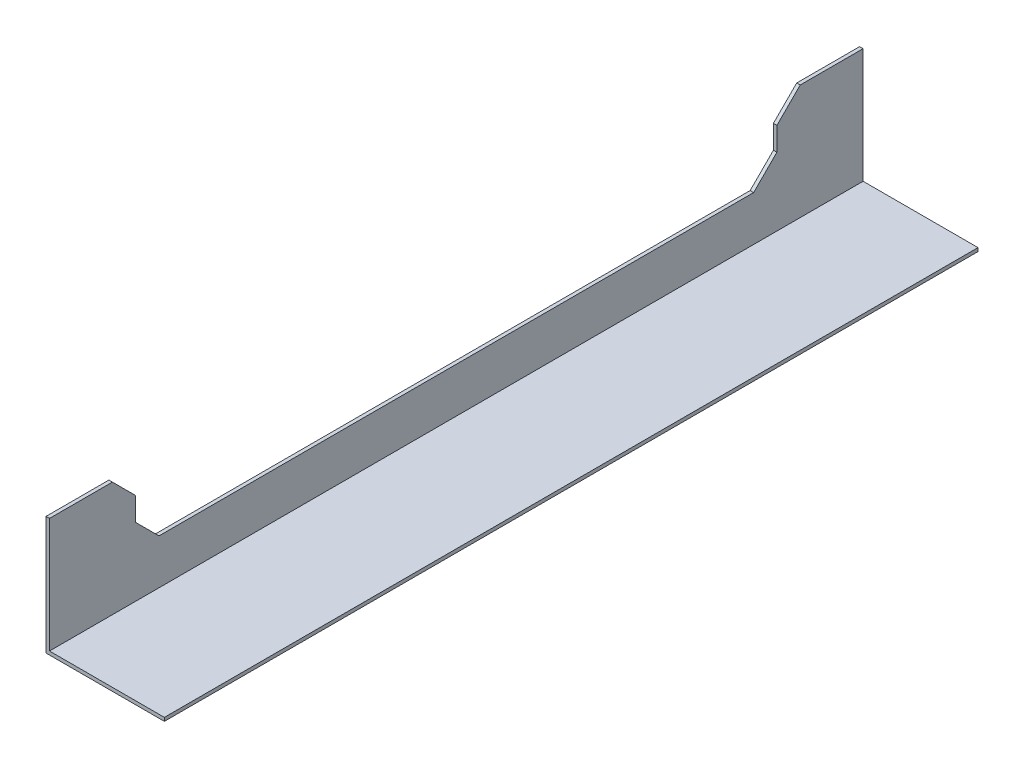
ISO-10303-21;
HEADER;
FILE_DESCRIPTION(('STEP AP214'),'2;1');
FILE_NAME('part.step','',(''),(''),'','','');
FILE_SCHEMA(('AUTOMOTIVE_DESIGN { 1 0 10303 214 1 1 1 1 }'));
ENDSEC;
DATA;
#1=APPLICATION_CONTEXT('core data for automotive mechanical design processes');
#2=APPLICATION_PROTOCOL_DEFINITION('international standard','automotive_design',2000,#1);
#3=PRODUCT_CONTEXT('',#1,'mechanical');
#4=PRODUCT('Part','Part','',(#3));
#5=PRODUCT_RELATED_PRODUCT_CATEGORY('part','',(#4));
#6=PRODUCT_DEFINITION_FORMATION('','',#4);
#7=PRODUCT_DEFINITION_CONTEXT('part definition',#1,'design');
#8=PRODUCT_DEFINITION('design','',#6,#7);
#9=PRODUCT_DEFINITION_SHAPE('','',#8);
#10=(LENGTH_UNIT() NAMED_UNIT(*) SI_UNIT(.MILLI.,.METRE.));
#11=(NAMED_UNIT(*) PLANE_ANGLE_UNIT() SI_UNIT($,.RADIAN.));
#12=(NAMED_UNIT(*) SI_UNIT($,.STERADIAN.) SOLID_ANGLE_UNIT());
#13=UNCERTAINTY_MEASURE_WITH_UNIT(LENGTH_MEASURE(1.E-05),#10,'distance_accuracy_value','');
#14=(GEOMETRIC_REPRESENTATION_CONTEXT(3) GLOBAL_UNCERTAINTY_ASSIGNED_CONTEXT((#13)) GLOBAL_UNIT_ASSIGNED_CONTEXT((#10,
#11,#12)) REPRESENTATION_CONTEXT('',''));
#15=CARTESIAN_POINT('',(0.,0.,0.));
#16=DIRECTION('',(0.,0.,1.));
#17=DIRECTION('',(1.,0.,0.));
#18=AXIS2_PLACEMENT_3D('',#15,#16,#17);
#19=CARTESIAN_POINT('',(1.49999999999995,1.49999999999995,349.2));
#20=DIRECTION('',(-1.,0.,0.));
#21=DIRECTION('',(0.,0.,1.));
#22=AXIS2_PLACEMENT_3D('',#19,#20,#21);
#23=PLANE('',#22);
#24=DIRECTION('',(0.,0.,-1.));
#25=VECTOR('',#24,1.);
#26=CARTESIAN_POINT('',(1.49999999999995,50.8,349.2));
#27=LINE('',#26,#25);
#28=CARTESIAN_POINT('',(1.49999999999995,50.8,27.));
#29=VERTEX_POINT('',#28);
#30=CARTESIAN_POINT('',(1.49999999999995,50.8,2.22044604925031E-13));
#31=VERTEX_POINT('',#30);
#32=EDGE_CURVE('E253',#29,#31,#27,.T.);
#33=ORIENTED_EDGE('',*,*,#32,.F.);
#34=DIRECTION('',(0.,-0.707106781186548,0.707106781186548));
#35=VECTOR('',#34,1.);
#36=CARTESIAN_POINT('',(1.49999999999995,50.8,27.));
#37=LINE('',#36,#35);
#38=CARTESIAN_POINT('',(1.50000000000006,40.7999999999998,37.0000000000002));
#39=VERTEX_POINT('',#38);
#40=EDGE_CURVE('E174',#29,#39,#37,.T.);
#41=ORIENTED_EDGE('',*,*,#40,.T.);
#42=DIRECTION('',(0.,1.,0.));
#43=VECTOR('',#42,1.);
#44=CARTESIAN_POINT('',(1.50000000000006,1.49999999999995,37.0000000000002));
#45=LINE('',#44,#43);
#46=CARTESIAN_POINT('',(1.50000000000006,30.8000000000001,37.));
#47=VERTEX_POINT('',#46);
#48=EDGE_CURVE('E226',#47,#39,#45,.T.);
#49=ORIENTED_EDGE('',*,*,#48,.F.);
#50=DIRECTION('',(0.,0.707106781186551,-0.707106781186544));
#51=VECTOR('',#50,1.);
#52=CARTESIAN_POINT('',(1.49999999999995,-139.95,207.749999999998));
#53=LINE('',#52,#51);
#54=CARTESIAN_POINT('',(1.49999999999961,20.8,47.));
#55=VERTEX_POINT('',#54);
#56=EDGE_CURVE('E196',#47,#55,#53,.F.);
#57=ORIENTED_EDGE('',*,*,#56,.T.);
#58=DIRECTION('',(0.,0.,-1.));
#59=VECTOR('',#58,1.);
#60=CARTESIAN_POINT('',(1.49999999999995,20.8,349.2));
#61=LINE('',#60,#59);
#62=CARTESIAN_POINT('',(1.49999999999995,20.8,302.2));
#63=VERTEX_POINT('',#62);
#64=EDGE_CURVE('E205',#63,#55,#61,.T.);
#65=ORIENTED_EDGE('',*,*,#64,.F.);
#66=DIRECTION('',(0.,-0.707106781186542,-0.707106781186553));
#67=VECTOR('',#66,1.);
#68=CARTESIAN_POINT('',(1.49999999999995,34.6500000000002,316.05));
#69=LINE('',#68,#67);
#70=CARTESIAN_POINT('',(1.49999999999995,30.7999999999998,312.2));
#71=VERTEX_POINT('',#70);
#72=EDGE_CURVE('E46',#63,#71,#69,.F.);
#73=ORIENTED_EDGE('',*,*,#72,.T.);
#74=DIRECTION('',(0.,-1.,0.));
#75=VECTOR('',#74,1.);
#76=CARTESIAN_POINT('',(1.49999999999995,1.49999999999995,312.2));
#77=LINE('',#76,#75);
#78=CARTESIAN_POINT('',(1.49999999999995,40.7999999999999,312.2));
#79=VERTEX_POINT('',#78);
#80=EDGE_CURVE('E204',#79,#71,#77,.T.);
#81=ORIENTED_EDGE('',*,*,#80,.F.);
#82=DIRECTION('',(0.,0.707106781186548,0.707106781186548));
#83=VECTOR('',#82,1.);
#84=CARTESIAN_POINT('',(1.49999999999995,40.7999999999999,312.2));
#85=LINE('',#84,#83);
#86=CARTESIAN_POINT('',(1.50000000000006,50.8,322.2));
#87=VERTEX_POINT('',#86);
#88=EDGE_CURVE('E167',#79,#87,#85,.T.);
#89=ORIENTED_EDGE('',*,*,#88,.T.);
#90=CARTESIAN_POINT('',(1.49999999999995,50.8,349.2));
#91=VERTEX_POINT('',#90);
#92=EDGE_CURVE('E254',#91,#87,#27,.T.);
#93=ORIENTED_EDGE('',*,*,#92,.F.);
#94=DIRECTION('',(0.,1.,0.));
#95=VECTOR('',#94,1.);
#96=CARTESIAN_POINT('',(1.49999999999995,1.49999999999995,349.2));
#97=LINE('',#96,#95);
#98=CARTESIAN_POINT('',(1.49999999999995,1.49999999999995,349.2));
#99=VERTEX_POINT('',#98);
#100=EDGE_CURVE('E230',#99,#91,#97,.T.);
#101=ORIENTED_EDGE('',*,*,#100,.F.);
#102=DIRECTION('',(0.,0.,-1.));
#103=VECTOR('',#102,1.);
#104=CARTESIAN_POINT('',(1.49999999999995,1.49999999999995,349.2));
#105=LINE('',#104,#103);
#106=CARTESIAN_POINT('',(1.49999999999995,1.49999999999995,2.22044604925031E-13));
#107=VERTEX_POINT('',#106);
#108=EDGE_CURVE('E169',#99,#107,#105,.T.);
#109=ORIENTED_EDGE('',*,*,#108,.T.);
#110=DIRECTION('',(0.,1.,0.));
#111=VECTOR('',#110,1.);
#112=CARTESIAN_POINT('',(1.49999999999995,1.49999999999995,2.22044604925031E-13));
#113=LINE('',#112,#111);
#114=EDGE_CURVE('E241',#107,#31,#113,.T.);
#115=ORIENTED_EDGE('',*,*,#114,.T.);
#116=EDGE_LOOP('',(#33,#41,#49,#57,#65,#73,#81,#89,#93,#101,#109,#115));
#117=FACE_BOUND('',#116,.T.);
#118=ADVANCED_FACE('F38',(#117),#23,.F.);
#119=CARTESIAN_POINT('',(1.49999999999995,50.8,349.2));
#120=DIRECTION('',(0.,-1.,0.));
#121=DIRECTION('',(0.,0.,-1.));
#122=AXIS2_PLACEMENT_3D('',#119,#120,#121);
#123=PLANE('',#122);
#124=DIRECTION('',(0.,0.,-1.));
#125=VECTOR('',#124,1.);
#126=CARTESIAN_POINT('',(0.,50.8,349.2));
#127=LINE('',#126,#125);
#128=CARTESIAN_POINT('',(0.,50.8,26.9999999999999));
#129=VERTEX_POINT('',#128);
#130=CARTESIAN_POINT('',(0.,50.8,0.));
#131=VERTEX_POINT('',#130);
#132=EDGE_CURVE('E249',#129,#131,#127,.T.);
#133=ORIENTED_EDGE('',*,*,#132,.F.);
#134=DIRECTION('',(1.,0.,0.));
#135=VECTOR('',#134,1.);
#136=CARTESIAN_POINT('',(1.49999999999995,50.8,27.));
#137=LINE('',#136,#135);
#138=EDGE_CURVE('E164',#129,#29,#137,.T.);
#139=ORIENTED_EDGE('',*,*,#138,.T.);
#140=ORIENTED_EDGE('',*,*,#32,.T.);
#141=DIRECTION('',(-1.,0.,0.));
#142=VECTOR('',#141,1.);
#143=CARTESIAN_POINT('',(1.49999999999995,50.8,2.22044604925031E-13));
#144=LINE('',#143,#142);
#145=EDGE_CURVE('E244',#31,#131,#144,.T.);
#146=ORIENTED_EDGE('',*,*,#145,.T.);
#147=EDGE_LOOP('',(#133,#139,#140,#146));
#148=FACE_BOUND('',#147,.T.);
#149=ADVANCED_FACE('F269',(#148),#123,.F.);
#150=ORIENTED_EDGE('',*,*,#92,.T.);
#151=DIRECTION('',(-1.,0.,0.));
#152=VECTOR('',#151,1.);
#153=CARTESIAN_POINT('',(0.,50.8,322.2));
#154=LINE('',#153,#152);
#155=CARTESIAN_POINT('',(0.,50.8,322.2));
#156=VERTEX_POINT('',#155);
#157=EDGE_CURVE('E194',#87,#156,#154,.T.);
#158=ORIENTED_EDGE('',*,*,#157,.T.);
#159=CARTESIAN_POINT('',(0.,50.8,349.2));
#160=VERTEX_POINT('',#159);
#161=EDGE_CURVE('E250',#160,#156,#127,.T.);
#162=ORIENTED_EDGE('',*,*,#161,.F.);
#163=DIRECTION('',(-1.,0.,0.));
#164=VECTOR('',#163,1.);
#165=CARTESIAN_POINT('',(1.49999999999995,50.8,349.2));
#166=LINE('',#165,#164);
#167=EDGE_CURVE('E232',#91,#160,#166,.T.);
#168=ORIENTED_EDGE('',*,*,#167,.F.);
#169=EDGE_LOOP('',(#150,#158,#162,#168));
#170=FACE_BOUND('',#169,.T.);
#171=ADVANCED_FACE('F295',(#170),#123,.F.);
#172=CARTESIAN_POINT('',(0.,0.,349.2));
#173=DIRECTION('',(1.,0.,0.));
#174=DIRECTION('',(0.,0.,-1.));
#175=AXIS2_PLACEMENT_3D('',#172,#173,#174);
#176=PLANE('',#175);
#177=DIRECTION('',(0.,1.,0.));
#178=VECTOR('',#177,1.);
#179=CARTESIAN_POINT('',(0.,50.8,37.));
#180=LINE('',#179,#178);
#181=CARTESIAN_POINT('',(0.,30.8000000000001,36.9999999999998));
#182=VERTEX_POINT('',#181);
#183=CARTESIAN_POINT('',(0.,40.7999999999998,37.));
#184=VERTEX_POINT('',#183);
#185=EDGE_CURVE('E219',#182,#184,#180,.T.);
#186=ORIENTED_EDGE('',*,*,#185,.T.);
#187=DIRECTION('',(0.,0.707106781186548,-0.707106781186548));
#188=VECTOR('',#187,1.);
#189=CARTESIAN_POINT('',(0.,50.8,26.9999999999999));
#190=LINE('',#189,#188);
#191=EDGE_CURVE('E183',#184,#129,#190,.T.);
#192=ORIENTED_EDGE('',*,*,#191,.T.);
#193=ORIENTED_EDGE('',*,*,#132,.T.);
#194=DIRECTION('',(0.,-1.,0.));
#195=VECTOR('',#194,1.);
#196=CARTESIAN_POINT('',(0.,0.,0.));
#197=LINE('',#196,#195);
#198=CARTESIAN_POINT('',(0.,0.,0.));
#199=VERTEX_POINT('',#198);
#200=EDGE_CURVE('E159',#131,#199,#197,.T.);
#201=ORIENTED_EDGE('',*,*,#200,.T.);
#202=DIRECTION('',(0.,0.,-1.));
#203=VECTOR('',#202,1.);
#204=CARTESIAN_POINT('',(0.,0.,349.2));
#205=LINE('',#204,#203);
#206=CARTESIAN_POINT('',(0.,0.,349.2));
#207=VERTEX_POINT('',#206);
#208=EDGE_CURVE('E235',#207,#199,#205,.T.);
#209=ORIENTED_EDGE('',*,*,#208,.F.);
#210=DIRECTION('',(0.,-1.,0.));
#211=VECTOR('',#210,1.);
#212=CARTESIAN_POINT('',(0.,0.,349.2));
#213=LINE('',#212,#211);
#214=EDGE_CURVE('E155',#160,#207,#213,.T.);
#215=ORIENTED_EDGE('',*,*,#214,.F.);
#216=ORIENTED_EDGE('',*,*,#161,.T.);
#217=DIRECTION('',(0.,-0.707106781186548,-0.707106781186548));
#218=VECTOR('',#217,1.);
#219=CARTESIAN_POINT('',(0.,40.7999999999999,312.2));
#220=LINE('',#219,#218);
#221=CARTESIAN_POINT('',(0.,40.7999999999999,312.2));
#222=VERTEX_POINT('',#221);
#223=EDGE_CURVE('E181',#156,#222,#220,.T.);
#224=ORIENTED_EDGE('',*,*,#223,.T.);
#225=DIRECTION('',(0.,-1.,0.));
#226=VECTOR('',#225,1.);
#227=CARTESIAN_POINT('',(0.,50.8,312.2));
#228=LINE('',#227,#226);
#229=CARTESIAN_POINT('',(0.,30.7999999999998,312.2));
#230=VERTEX_POINT('',#229);
#231=EDGE_CURVE('E213',#222,#230,#228,.T.);
#232=ORIENTED_EDGE('',*,*,#231,.T.);
#233=DIRECTION('',(0.,0.707106781186542,0.707106781186553));
#234=VECTOR('',#233,1.);
#235=CARTESIAN_POINT('',(0.,33.9000000000002,315.3));
#236=LINE('',#235,#234);
#237=CARTESIAN_POINT('',(0.,20.8,302.2));
#238=VERTEX_POINT('',#237);
#239=EDGE_CURVE('E11',#230,#238,#236,.F.);
#240=ORIENTED_EDGE('',*,*,#239,.T.);
#241=DIRECTION('',(0.,0.,-1.));
#242=VECTOR('',#241,1.);
#243=CARTESIAN_POINT('',(0.,20.8,312.2));
#244=LINE('',#243,#242);
#245=CARTESIAN_POINT('',(-4.44089209850063E-13,20.8,46.9999999999998));
#246=VERTEX_POINT('',#245);
#247=EDGE_CURVE('E217',#238,#246,#244,.T.);
#248=ORIENTED_EDGE('',*,*,#247,.T.);
#249=DIRECTION('',(0.,-0.707106781186551,0.707106781186544));
#250=VECTOR('',#249,1.);
#251=CARTESIAN_POINT('',(0.,-140.7,208.499999999998));
#252=LINE('',#251,#250);
#253=EDGE_CURVE('E198',#246,#182,#252,.F.);
#254=ORIENTED_EDGE('',*,*,#253,.T.);
#255=EDGE_LOOP('',(#186,#192,#193,#201,#209,#215,#216,#224,#232,#240,#248,#254));
#256=FACE_BOUND('',#255,.T.);
#257=ADVANCED_FACE('F280',(#256),#176,.F.);
#258=CARTESIAN_POINT('',(0.,0.,349.2));
#259=DIRECTION('',(0.,1.,0.));
#260=DIRECTION('',(0.,0.,1.));
#261=AXIS2_PLACEMENT_3D('',#258,#259,#260);
#262=PLANE('',#261);
#263=DIRECTION('',(1.,0.,0.));
#264=VECTOR('',#263,1.);
#265=CARTESIAN_POINT('',(0.,0.,0.));
#266=LINE('',#265,#264);
#267=CARTESIAN_POINT('',(50.8,0.,2.22044604925031E-13));
#268=VERTEX_POINT('',#267);
#269=EDGE_CURVE('E163',#199,#268,#266,.T.);
#270=ORIENTED_EDGE('',*,*,#269,.T.);
#271=DIRECTION('',(0.,0.,-1.));
#272=VECTOR('',#271,1.);
#273=CARTESIAN_POINT('',(50.8,0.,349.2));
#274=LINE('',#273,#272);
#275=CARTESIAN_POINT('',(50.8,0.,349.2));
#276=VERTEX_POINT('',#275);
#277=EDGE_CURVE('E143',#276,#268,#274,.T.);
#278=ORIENTED_EDGE('',*,*,#277,.F.);
#279=DIRECTION('',(1.,0.,0.));
#280=VECTOR('',#279,1.);
#281=CARTESIAN_POINT('',(0.,0.,349.2));
#282=LINE('',#281,#280);
#283=EDGE_CURVE('E150',#207,#276,#282,.T.);
#284=ORIENTED_EDGE('',*,*,#283,.F.);
#285=ORIENTED_EDGE('',*,*,#208,.T.);
#286=EDGE_LOOP('',(#270,#278,#284,#285));
#287=FACE_BOUND('',#286,.T.);
#288=ADVANCED_FACE('F161',(#287),#262,.F.);
#289=CARTESIAN_POINT('',(50.8,1.49999999999995,349.2));
#290=DIRECTION('',(-1.,0.,0.));
#291=DIRECTION('',(0.,0.,1.));
#292=AXIS2_PLACEMENT_3D('',#289,#290,#291);
#293=PLANE('',#292);
#294=DIRECTION('',(0.,1.,0.));
#295=VECTOR('',#294,1.);
#296=CARTESIAN_POINT('',(50.8,1.49999999999995,2.22044604925031E-13));
#297=LINE('',#296,#295);
#298=CARTESIAN_POINT('',(50.8,1.49999999999995,2.22044604925031E-13));
#299=VERTEX_POINT('',#298);
#300=EDGE_CURVE('E237',#268,#299,#297,.T.);
#301=ORIENTED_EDGE('',*,*,#300,.T.);
#302=DIRECTION('',(0.,0.,-1.));
#303=VECTOR('',#302,1.);
#304=CARTESIAN_POINT('',(50.8,1.49999999999995,349.2));
#305=LINE('',#304,#303);
#306=CARTESIAN_POINT('',(50.8,1.49999999999995,349.2));
#307=VERTEX_POINT('',#306);
#308=EDGE_CURVE('E146',#307,#299,#305,.T.);
#309=ORIENTED_EDGE('',*,*,#308,.F.);
#310=DIRECTION('',(0.,1.,0.));
#311=VECTOR('',#310,1.);
#312=CARTESIAN_POINT('',(50.8,1.49999999999995,349.2));
#313=LINE('',#312,#311);
#314=EDGE_CURVE('E139',#276,#307,#313,.T.);
#315=ORIENTED_EDGE('',*,*,#314,.F.);
#316=ORIENTED_EDGE('',*,*,#277,.T.);
#317=EDGE_LOOP('',(#301,#309,#315,#316));
#318=FACE_BOUND('',#317,.T.);
#319=ADVANCED_FACE('F141',(#318),#293,.F.);
#320=CARTESIAN_POINT('',(1.49999999999995,1.49999999999995,349.2));
#321=DIRECTION('',(0.,-1.,0.));
#322=DIRECTION('',(0.,0.,-1.));
#323=AXIS2_PLACEMENT_3D('',#320,#321,#322);
#324=PLANE('',#323);
#325=DIRECTION('',(-1.,0.,0.));
#326=VECTOR('',#325,1.);
#327=CARTESIAN_POINT('',(1.49999999999995,1.49999999999995,2.22044604925031E-13));
#328=LINE('',#327,#326);
#329=EDGE_CURVE('E239',#299,#107,#328,.T.);
#330=ORIENTED_EDGE('',*,*,#329,.T.);
#331=ORIENTED_EDGE('',*,*,#108,.F.);
#332=DIRECTION('',(-1.,0.,0.));
#333=VECTOR('',#332,1.);
#334=CARTESIAN_POINT('',(1.49999999999995,1.49999999999995,349.2));
#335=LINE('',#334,#333);
#336=EDGE_CURVE('E149',#307,#99,#335,.T.);
#337=ORIENTED_EDGE('',*,*,#336,.F.);
#338=ORIENTED_EDGE('',*,*,#308,.T.);
#339=EDGE_LOOP('',(#330,#331,#337,#338));
#340=FACE_BOUND('',#339,.T.);
#341=ADVANCED_FACE('F299',(#340),#324,.F.);
#342=CARTESIAN_POINT('',(0.,0.,349.2));
#343=DIRECTION('',(0.,0.,-1.));
#344=DIRECTION('',(-1.,0.,0.));
#345=AXIS2_PLACEMENT_3D('',#342,#343,#344);
#346=PLANE('',#345);
#347=ORIENTED_EDGE('',*,*,#283,.T.);
#348=ORIENTED_EDGE('',*,*,#314,.T.);
#349=ORIENTED_EDGE('',*,*,#336,.T.);
#350=ORIENTED_EDGE('',*,*,#100,.T.);
#351=ORIENTED_EDGE('',*,*,#167,.T.);
#352=ORIENTED_EDGE('',*,*,#214,.T.);
#353=EDGE_LOOP('',(#347,#348,#349,#350,#351,#352));
#354=FACE_BOUND('',#353,.T.);
#355=ADVANCED_FACE('F153',(#354),#346,.F.);
#356=CARTESIAN_POINT('',(0.,0.,0.));
#357=DIRECTION('',(0.,0.,-1.));
#358=DIRECTION('',(-1.,0.,0.));
#359=AXIS2_PLACEMENT_3D('',#356,#357,#358);
#360=PLANE('',#359);
#361=ORIENTED_EDGE('',*,*,#269,.F.);
#362=ORIENTED_EDGE('',*,*,#200,.F.);
#363=ORIENTED_EDGE('',*,*,#145,.F.);
#364=ORIENTED_EDGE('',*,*,#114,.F.);
#365=ORIENTED_EDGE('',*,*,#329,.F.);
#366=ORIENTED_EDGE('',*,*,#300,.F.);
#367=EDGE_LOOP('',(#361,#362,#363,#364,#365,#366));
#368=FACE_BOUND('',#367,.T.);
#369=ADVANCED_FACE('F265',(#368),#360,.T.);
#370=CARTESIAN_POINT('',(-509.141952692966,50.8,37.));
#371=DIRECTION('',(0.,0.,1.));
#372=DIRECTION('',(1.,0.,0.));
#373=AXIS2_PLACEMENT_3D('',#370,#371,#372);
#374=PLANE('',#373);
#375=ORIENTED_EDGE('',*,*,#48,.T.);
#376=DIRECTION('',(-1.,0.,0.));
#377=VECTOR('',#376,1.);
#378=CARTESIAN_POINT('',(0.,40.7999999999998,37.));
#379=LINE('',#378,#377);
#380=EDGE_CURVE('E179',#39,#184,#379,.T.);
#381=ORIENTED_EDGE('',*,*,#380,.T.);
#382=ORIENTED_EDGE('',*,*,#185,.F.);
#383=DIRECTION('',(1.,0.,0.));
#384=VECTOR('',#383,1.);
#385=CARTESIAN_POINT('',(1.50000000000006,30.8000000000001,37.));
#386=LINE('',#385,#384);
#387=EDGE_CURVE('E176',#182,#47,#386,.T.);
#388=ORIENTED_EDGE('',*,*,#387,.T.);
#389=EDGE_LOOP('',(#375,#381,#382,#388));
#390=FACE_BOUND('',#389,.T.);
#391=ADVANCED_FACE('F275',(#390),#374,.T.);
#392=CARTESIAN_POINT('',(-509.141952692966,20.8,312.2));
#393=DIRECTION('',(0.,1.,0.));
#394=DIRECTION('',(0.,0.,1.));
#395=AXIS2_PLACEMENT_3D('',#392,#393,#394);
#396=PLANE('',#395);
#397=ORIENTED_EDGE('',*,*,#64,.T.);
#398=DIRECTION('',(-1.,0.,0.));
#399=VECTOR('',#398,1.);
#400=CARTESIAN_POINT('',(-4.44089209850063E-13,20.8,46.9999999999998));
#401=LINE('',#400,#399);
#402=EDGE_CURVE('E53',#55,#246,#401,.T.);
#403=ORIENTED_EDGE('',*,*,#402,.T.);
#404=ORIENTED_EDGE('',*,*,#247,.F.);
#405=DIRECTION('',(1.,0.,0.));
#406=VECTOR('',#405,1.);
#407=CARTESIAN_POINT('',(1.49999999999995,20.8,302.2));
#408=LINE('',#407,#406);
#409=EDGE_CURVE('E185',#238,#63,#408,.T.);
#410=ORIENTED_EDGE('',*,*,#409,.T.);
#411=EDGE_LOOP('',(#397,#403,#404,#410));
#412=FACE_BOUND('',#411,.T.);
#413=ADVANCED_FACE('F216',(#412),#396,.T.);
#414=CARTESIAN_POINT('',(-509.141952692966,50.8,312.2));
#415=DIRECTION('',(0.,0.,-1.));
#416=DIRECTION('',(-1.,0.,0.));
#417=AXIS2_PLACEMENT_3D('',#414,#415,#416);
#418=PLANE('',#417);
#419=ORIENTED_EDGE('',*,*,#80,.T.);
#420=DIRECTION('',(-1.,0.,0.));
#421=VECTOR('',#420,1.);
#422=CARTESIAN_POINT('',(0.,30.7999999999998,312.2));
#423=LINE('',#422,#421);
#424=EDGE_CURVE('E192',#71,#230,#423,.T.);
#425=ORIENTED_EDGE('',*,*,#424,.T.);
#426=ORIENTED_EDGE('',*,*,#231,.F.);
#427=DIRECTION('',(1.,0.,0.));
#428=VECTOR('',#427,1.);
#429=CARTESIAN_POINT('',(1.49999999999995,40.7999999999999,312.2));
#430=LINE('',#429,#428);
#431=EDGE_CURVE('E189',#222,#79,#430,.T.);
#432=ORIENTED_EDGE('',*,*,#431,.T.);
#433=EDGE_LOOP('',(#419,#425,#426,#432));
#434=FACE_BOUND('',#433,.T.);
#435=ADVANCED_FACE('F210',(#434),#418,.T.);
#436=CARTESIAN_POINT('',(1.49999999999995,50.8,27.));
#437=DIRECTION('',(0.,0.707106781186547,0.707106781186547));
#438=DIRECTION('',(-1.,0.,0.));
#439=AXIS2_PLACEMENT_3D('',#436,#437,#438);
#440=PLANE('',#439);
#441=ORIENTED_EDGE('',*,*,#191,.F.);
#442=ORIENTED_EDGE('',*,*,#380,.F.);
#443=ORIENTED_EDGE('',*,*,#40,.F.);
#444=ORIENTED_EDGE('',*,*,#138,.F.);
#445=EDGE_LOOP('',(#441,#442,#443,#444));
#446=FACE_BOUND('',#445,.T.);
#447=ADVANCED_FACE('F279',(#446),#440,.T.);
#448=CARTESIAN_POINT('',(-509.141952692966,30.8000000000001,36.9999999999998));
#449=DIRECTION('',(0.,0.707106781186543,0.707106781186551));
#450=DIRECTION('',(-1.,0.,0.));
#451=AXIS2_PLACEMENT_3D('',#448,#449,#450);
#452=PLANE('',#451);
#453=ORIENTED_EDGE('',*,*,#253,.F.);
#454=ORIENTED_EDGE('',*,*,#402,.F.);
#455=ORIENTED_EDGE('',*,*,#56,.F.);
#456=ORIENTED_EDGE('',*,*,#387,.F.);
#457=EDGE_LOOP('',(#453,#454,#455,#456));
#458=FACE_BOUND('',#457,.T.);
#459=ADVANCED_FACE('F282',(#458),#452,.T.);
#460=CARTESIAN_POINT('',(-509.141952692966,20.8,302.2));
#461=DIRECTION('',(0.,0.707106781186553,-0.707106781186542));
#462=DIRECTION('',(-1.,0.,0.));
#463=AXIS2_PLACEMENT_3D('',#460,#461,#462);
#464=PLANE('',#463);
#465=ORIENTED_EDGE('',*,*,#239,.F.);
#466=ORIENTED_EDGE('',*,*,#424,.F.);
#467=ORIENTED_EDGE('',*,*,#72,.F.);
#468=ORIENTED_EDGE('',*,*,#409,.F.);
#469=EDGE_LOOP('',(#465,#466,#467,#468));
#470=FACE_BOUND('',#469,.T.);
#471=ADVANCED_FACE('F215',(#470),#464,.T.);
#472=CARTESIAN_POINT('',(-509.141952692966,40.7999999999999,312.2));
#473=DIRECTION('',(0.,0.707106781186547,-0.707106781186547));
#474=DIRECTION('',(-1.,0.,0.));
#475=AXIS2_PLACEMENT_3D('',#472,#473,#474);
#476=PLANE('',#475);
#477=ORIENTED_EDGE('',*,*,#223,.F.);
#478=ORIENTED_EDGE('',*,*,#157,.F.);
#479=ORIENTED_EDGE('',*,*,#88,.F.);
#480=ORIENTED_EDGE('',*,*,#431,.F.);
#481=EDGE_LOOP('',(#477,#478,#479,#480));
#482=FACE_BOUND('',#481,.T.);
#483=ADVANCED_FACE('F40',(#482),#476,.T.);
#484=CLOSED_SHELL('',(#118,#149,#171,#257,#288,#319,#341,#355,#369,#391,#413,#435,#447,#459,
#471,#483));
#485=MANIFOLD_SOLID_BREP('B2',#484);
#486=ADVANCED_BREP_SHAPE_REPRESENTATION('',(#18,#485),#14);
#487=SHAPE_DEFINITION_REPRESENTATION(#9,#486);
ENDSEC;
END-ISO-10303-21;
